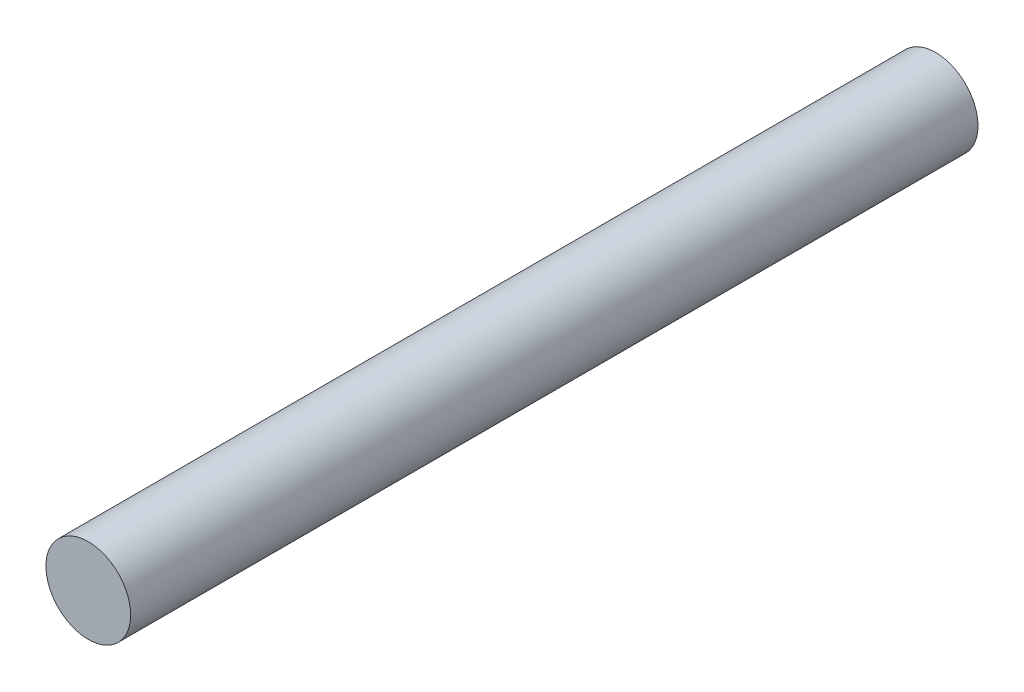
ISO-10303-21;
HEADER;
FILE_DESCRIPTION(('STEP AP214'),'2;1');
FILE_NAME('part.step','',(''),(''),'','','');
FILE_SCHEMA(('AUTOMOTIVE_DESIGN { 1 0 10303 214 1 1 1 1 }'));
ENDSEC;
DATA;
#1=APPLICATION_CONTEXT('core data for automotive mechanical design processes');
#2=APPLICATION_PROTOCOL_DEFINITION('international standard','automotive_design',2000,#1);
#3=PRODUCT_CONTEXT('',#1,'mechanical');
#4=PRODUCT('Part','Part','',(#3));
#5=PRODUCT_RELATED_PRODUCT_CATEGORY('part','',(#4));
#6=PRODUCT_DEFINITION_FORMATION('','',#4);
#7=PRODUCT_DEFINITION_CONTEXT('part definition',#1,'design');
#8=PRODUCT_DEFINITION('design','',#6,#7);
#9=PRODUCT_DEFINITION_SHAPE('','',#8);
#10=(LENGTH_UNIT() NAMED_UNIT(*) SI_UNIT(.MILLI.,.METRE.));
#11=(NAMED_UNIT(*) PLANE_ANGLE_UNIT() SI_UNIT($,.RADIAN.));
#12=(NAMED_UNIT(*) SI_UNIT($,.STERADIAN.) SOLID_ANGLE_UNIT());
#13=UNCERTAINTY_MEASURE_WITH_UNIT(LENGTH_MEASURE(1.E-05),#10,'distance_accuracy_value','');
#14=(GEOMETRIC_REPRESENTATION_CONTEXT(3) GLOBAL_UNCERTAINTY_ASSIGNED_CONTEXT((#13)) GLOBAL_UNIT_ASSIGNED_CONTEXT((#10,
#11,#12)) REPRESENTATION_CONTEXT('',''));
#15=CARTESIAN_POINT('',(0.,0.,0.));
#16=DIRECTION('',(0.,0.,1.));
#17=DIRECTION('',(1.,0.,0.));
#18=AXIS2_PLACEMENT_3D('',#15,#16,#17);
#19=CARTESIAN_POINT('',(0.,0.,10.));
#20=DIRECTION('',(0.,0.,-1.));
#21=DIRECTION('',(-1.,0.,0.));
#22=AXIS2_PLACEMENT_3D('',#19,#20,#21);
#23=CYLINDRICAL_SURFACE('',#22,0.5);
#24=CARTESIAN_POINT('',(0.,0.,10.));
#25=DIRECTION('',(0.,0.,1.));
#26=DIRECTION('',(1.,0.,0.));
#27=AXIS2_PLACEMENT_3D('',#24,#25,#26);
#28=CIRCLE('',#27,0.5);
#29=CARTESIAN_POINT('',(0.5,0.,10.));
#30=VERTEX_POINT('',#29);
#31=EDGE_CURVE('E10',#30,#30,#28,.T.);
#32=ORIENTED_EDGE('',*,*,#31,.F.);
#33=EDGE_LOOP('',(#32));
#34=FACE_BOUND('',#33,.T.);
#35=CARTESIAN_POINT('',(0.,0.,0.));
#36=DIRECTION('',(0.,0.,1.));
#37=DIRECTION('',(1.,0.,0.));
#38=AXIS2_PLACEMENT_3D('',#35,#36,#37);
#39=CIRCLE('',#38,0.5);
#40=CARTESIAN_POINT('',(0.5,0.,0.));
#41=VERTEX_POINT('',#40);
#42=EDGE_CURVE('E40',#41,#41,#39,.T.);
#43=ORIENTED_EDGE('',*,*,#42,.T.);
#44=EDGE_LOOP('',(#43));
#45=FACE_BOUND('',#44,.T.);
#46=ADVANCED_FACE('F37',(#34,#45),#23,.T.);
#47=CARTESIAN_POINT('',(0.,0.,10.));
#48=DIRECTION('',(0.,0.,1.));
#49=DIRECTION('',(1.,0.,0.));
#50=AXIS2_PLACEMENT_3D('',#47,#48,#49);
#51=PLANE('',#50);
#52=ORIENTED_EDGE('',*,*,#31,.T.);
#53=EDGE_LOOP('',(#52));
#54=FACE_BOUND('',#53,.T.);
#55=ADVANCED_FACE('F54',(#54),#51,.T.);
#56=CARTESIAN_POINT('',(0.,0.,0.));
#57=DIRECTION('',(0.,0.,1.));
#58=DIRECTION('',(1.,0.,0.));
#59=AXIS2_PLACEMENT_3D('',#56,#57,#58);
#60=PLANE('',#59);
#61=ORIENTED_EDGE('',*,*,#42,.F.);
#62=EDGE_LOOP('',(#61));
#63=FACE_BOUND('',#62,.T.);
#64=ADVANCED_FACE('F52',(#63),#60,.F.);
#65=CLOSED_SHELL('',(#46,#55,#64));
#66=MANIFOLD_SOLID_BREP('B2',#65);
#67=ADVANCED_BREP_SHAPE_REPRESENTATION('',(#18,#66),#14);
#68=SHAPE_DEFINITION_REPRESENTATION(#9,#67);
ENDSEC;
END-ISO-10303-21;
